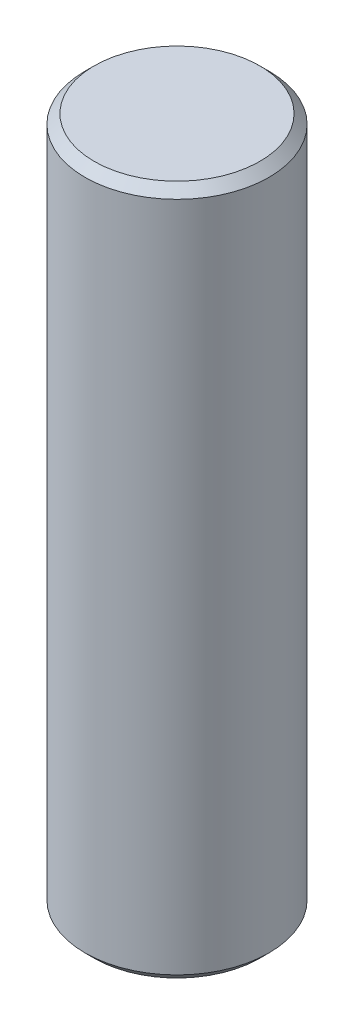
ISO-10303-21;
HEADER;
FILE_DESCRIPTION(('STEP AP214'),'2;1');
FILE_NAME('part.step','',(''),(''),'','','');
FILE_SCHEMA(('AUTOMOTIVE_DESIGN { 1 0 10303 214 1 1 1 1 }'));
ENDSEC;
DATA;
#1=APPLICATION_CONTEXT('core data for automotive mechanical design processes');
#2=APPLICATION_PROTOCOL_DEFINITION('international standard','automotive_design',2000,#1);
#3=PRODUCT_CONTEXT('',#1,'mechanical');
#4=PRODUCT('Part','Part','',(#3));
#5=PRODUCT_RELATED_PRODUCT_CATEGORY('part','',(#4));
#6=PRODUCT_DEFINITION_FORMATION('','',#4);
#7=PRODUCT_DEFINITION_CONTEXT('part definition',#1,'design');
#8=PRODUCT_DEFINITION('design','',#6,#7);
#9=PRODUCT_DEFINITION_SHAPE('','',#8);
#10=(LENGTH_UNIT() NAMED_UNIT(*) SI_UNIT(.MILLI.,.METRE.));
#11=(NAMED_UNIT(*) PLANE_ANGLE_UNIT() SI_UNIT($,.RADIAN.));
#12=(NAMED_UNIT(*) SI_UNIT($,.STERADIAN.) SOLID_ANGLE_UNIT());
#13=UNCERTAINTY_MEASURE_WITH_UNIT(LENGTH_MEASURE(1.E-05),#10,'distance_accuracy_value','');
#14=(GEOMETRIC_REPRESENTATION_CONTEXT(3) GLOBAL_UNCERTAINTY_ASSIGNED_CONTEXT((#13)) GLOBAL_UNIT_ASSIGNED_CONTEXT((#10,
#11,#12)) REPRESENTATION_CONTEXT('',''));
#15=CARTESIAN_POINT('',(0.,0.,0.));
#16=DIRECTION('',(0.,0.,1.));
#17=DIRECTION('',(1.,0.,0.));
#18=AXIS2_PLACEMENT_3D('',#15,#16,#17);
#19=CARTESIAN_POINT('',(0.,15.,0.));
#20=DIRECTION('',(0.,-1.,0.));
#21=DIRECTION('',(0.,0.,-1.));
#22=AXIS2_PLACEMENT_3D('',#19,#20,#21);
#23=CYLINDRICAL_SURFACE('',#22,2.);
#24=CARTESIAN_POINT('',(0.,0.200000000000001,0.));
#25=DIRECTION('',(0.,1.,0.));
#26=DIRECTION('',(0.,0.,1.));
#27=AXIS2_PLACEMENT_3D('',#24,#25,#26);
#28=CIRCLE('',#27,2.);
#29=CARTESIAN_POINT('',(0.,0.200000000000001,2.));
#30=VERTEX_POINT('',#29);
#31=EDGE_CURVE('E55',#30,#30,#28,.T.);
#32=ORIENTED_EDGE('',*,*,#31,.T.);
#33=EDGE_LOOP('',(#32));
#34=FACE_BOUND('',#33,.T.);
#35=CARTESIAN_POINT('',(0.,14.8,0.));
#36=DIRECTION('',(0.,1.,0.));
#37=DIRECTION('',(0.,0.,1.));
#38=AXIS2_PLACEMENT_3D('',#35,#36,#37);
#39=CIRCLE('',#38,2.);
#40=CARTESIAN_POINT('',(0.,14.8,2.));
#41=VERTEX_POINT('',#40);
#42=EDGE_CURVE('E60',#41,#41,#39,.F.);
#43=ORIENTED_EDGE('',*,*,#42,.T.);
#44=EDGE_LOOP('',(#43));
#45=FACE_BOUND('',#44,.T.);
#46=ADVANCED_FACE('F41',(#34,#45),#23,.T.);
#47=CARTESIAN_POINT('',(0.,15.,0.));
#48=DIRECTION('',(0.,1.,0.));
#49=DIRECTION('',(0.,0.,1.));
#50=AXIS2_PLACEMENT_3D('',#47,#48,#49);
#51=PLANE('',#50);
#52=CARTESIAN_POINT('',(0.,15.,0.));
#53=DIRECTION('',(0.,1.,0.));
#54=DIRECTION('',(0.,0.,1.));
#55=AXIS2_PLACEMENT_3D('',#52,#53,#54);
#56=CIRCLE('',#55,1.8);
#57=CARTESIAN_POINT('',(0.,15.,1.8));
#58=VERTEX_POINT('',#57);
#59=EDGE_CURVE('E10',#58,#58,#56,.T.);
#60=ORIENTED_EDGE('',*,*,#59,.T.);
#61=EDGE_LOOP('',(#60));
#62=FACE_BOUND('',#61,.T.);
#63=ADVANCED_FACE('F77',(#62),#51,.T.);
#64=CARTESIAN_POINT('',(0.,0.,0.));
#65=DIRECTION('',(0.,1.,0.));
#66=DIRECTION('',(0.,0.,1.));
#67=AXIS2_PLACEMENT_3D('',#64,#65,#66);
#68=PLANE('',#67);
#69=CARTESIAN_POINT('',(0.,0.,0.));
#70=DIRECTION('',(0.,1.,0.));
#71=DIRECTION('',(0.,0.,1.));
#72=AXIS2_PLACEMENT_3D('',#69,#70,#71);
#73=CIRCLE('',#72,1.8);
#74=CARTESIAN_POINT('',(0.,0.,1.8));
#75=VERTEX_POINT('',#74);
#76=EDGE_CURVE('E50',#75,#75,#73,.F.);
#77=ORIENTED_EDGE('',*,*,#76,.T.);
#78=EDGE_LOOP('',(#77));
#79=FACE_BOUND('',#78,.T.);
#80=ADVANCED_FACE('F74',(#79),#68,.F.);
#81=CARTESIAN_POINT('',(0.,0.200000000000001,0.));
#82=DIRECTION('',(0.,1.,0.));
#83=DIRECTION('',(0.,0.,1.));
#84=AXIS2_PLACEMENT_3D('',#81,#82,#83);
#85=CONICAL_SURFACE('',#84,2.,0.785398163397448);
#86=ORIENTED_EDGE('',*,*,#76,.F.);
#87=EDGE_LOOP('',(#86));
#88=FACE_BOUND('',#87,.T.);
#89=ORIENTED_EDGE('',*,*,#31,.F.);
#90=EDGE_LOOP('',(#89));
#91=FACE_BOUND('',#90,.T.);
#92=ADVANCED_FACE('F70',(#88,#91),#85,.T.);
#93=CARTESIAN_POINT('',(0.,15.,0.));
#94=DIRECTION('',(0.,-1.,0.));
#95=DIRECTION('',(0.,0.,-1.));
#96=AXIS2_PLACEMENT_3D('',#93,#94,#95);
#97=CONICAL_SURFACE('',#96,1.8,0.78539816339744);
#98=ORIENTED_EDGE('',*,*,#42,.F.);
#99=EDGE_LOOP('',(#98));
#100=FACE_BOUND('',#99,.T.);
#101=ORIENTED_EDGE('',*,*,#59,.F.);
#102=EDGE_LOOP('',(#101));
#103=FACE_BOUND('',#102,.T.);
#104=ADVANCED_FACE('F44',(#100,#103),#97,.T.);
#105=CLOSED_SHELL('',(#46,#63,#80,#92,#104));
#106=MANIFOLD_SOLID_BREP('B2',#105);
#107=ADVANCED_BREP_SHAPE_REPRESENTATION('',(#18,#106),#14);
#108=SHAPE_DEFINITION_REPRESENTATION(#9,#107);
ENDSEC;
END-ISO-10303-21;
